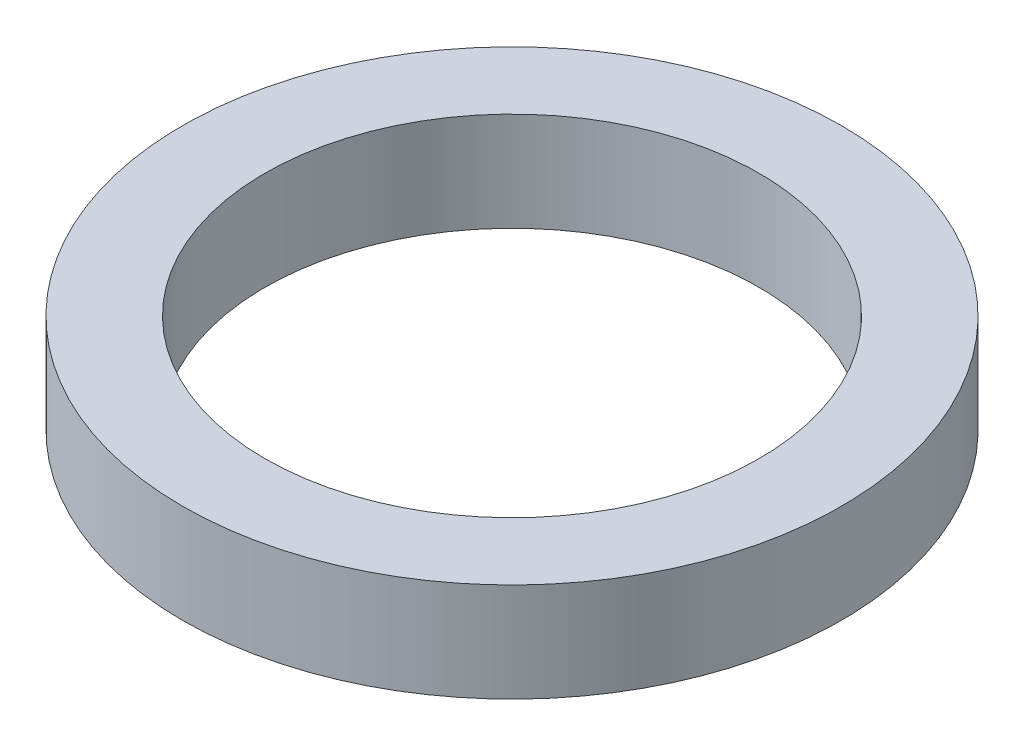
ISO-10303-21;
HEADER;
FILE_DESCRIPTION(('STEP AP214'),'2;1');
FILE_NAME('part.step','',(''),(''),'','','');
FILE_SCHEMA(('AUTOMOTIVE_DESIGN { 1 0 10303 214 1 1 1 1 }'));
ENDSEC;
DATA;
#1=APPLICATION_CONTEXT('core data for automotive mechanical design processes');
#2=APPLICATION_PROTOCOL_DEFINITION('international standard','automotive_design',2000,#1);
#3=PRODUCT_CONTEXT('',#1,'mechanical');
#4=PRODUCT('Part','Part','',(#3));
#5=PRODUCT_RELATED_PRODUCT_CATEGORY('part','',(#4));
#6=PRODUCT_DEFINITION_FORMATION('','',#4);
#7=PRODUCT_DEFINITION_CONTEXT('part definition',#1,'design');
#8=PRODUCT_DEFINITION('design','',#6,#7);
#9=PRODUCT_DEFINITION_SHAPE('','',#8);
#10=(LENGTH_UNIT() NAMED_UNIT(*) SI_UNIT(.MILLI.,.METRE.));
#11=(NAMED_UNIT(*) PLANE_ANGLE_UNIT() SI_UNIT($,.RADIAN.));
#12=(NAMED_UNIT(*) SI_UNIT($,.STERADIAN.) SOLID_ANGLE_UNIT());
#13=UNCERTAINTY_MEASURE_WITH_UNIT(LENGTH_MEASURE(1.E-05),#10,'distance_accuracy_value','');
#14=(GEOMETRIC_REPRESENTATION_CONTEXT(3) GLOBAL_UNCERTAINTY_ASSIGNED_CONTEXT((#13)) GLOBAL_UNIT_ASSIGNED_CONTEXT((#10,
#11,#12)) REPRESENTATION_CONTEXT('',''));
#15=CARTESIAN_POINT('',(0.,0.,0.));
#16=DIRECTION('',(0.,0.,1.));
#17=DIRECTION('',(1.,0.,0.));
#18=AXIS2_PLACEMENT_3D('',#15,#16,#17);
#19=CARTESIAN_POINT('',(0.,18.,0.));
#20=DIRECTION('',(0.,-1.,0.));
#21=DIRECTION('',(0.,0.,-1.));
#22=AXIS2_PLACEMENT_3D('',#19,#20,#21);
#23=CYLINDRICAL_SURFACE('',#22,60.);
#24=CARTESIAN_POINT('',(0.,18.,0.));
#25=DIRECTION('',(0.,1.,0.));
#26=DIRECTION('',(0.,0.,1.));
#27=AXIS2_PLACEMENT_3D('',#24,#25,#26);
#28=CIRCLE('',#27,60.);
#29=CARTESIAN_POINT('',(0.,18.,60.));
#30=VERTEX_POINT('',#29);
#31=EDGE_CURVE('E10',#30,#30,#28,.T.);
#32=ORIENTED_EDGE('',*,*,#31,.F.);
#33=EDGE_LOOP('',(#32));
#34=FACE_BOUND('',#33,.T.);
#35=CARTESIAN_POINT('',(0.,0.,0.));
#36=DIRECTION('',(0.,1.,0.));
#37=DIRECTION('',(0.,0.,1.));
#38=AXIS2_PLACEMENT_3D('',#35,#36,#37);
#39=CIRCLE('',#38,60.);
#40=CARTESIAN_POINT('',(0.,0.,60.));
#41=VERTEX_POINT('',#40);
#42=EDGE_CURVE('E37',#41,#41,#39,.T.);
#43=ORIENTED_EDGE('',*,*,#42,.T.);
#44=EDGE_LOOP('',(#43));
#45=FACE_BOUND('',#44,.T.);
#46=ADVANCED_FACE('F40',(#34,#45),#23,.T.);
#47=CARTESIAN_POINT('',(0.,18.,0.));
#48=DIRECTION('',(0.,1.,0.));
#49=DIRECTION('',(0.,0.,1.));
#50=AXIS2_PLACEMENT_3D('',#47,#48,#49);
#51=PLANE('',#50);
#52=CARTESIAN_POINT('',(0.,18.,0.));
#53=DIRECTION('',(0.,1.,0.));
#54=DIRECTION('',(0.,0.,1.));
#55=AXIS2_PLACEMENT_3D('',#52,#53,#54);
#56=CIRCLE('',#55,45.);
#57=CARTESIAN_POINT('',(0.,18.,45.));
#58=VERTEX_POINT('',#57);
#59=EDGE_CURVE('E50',#58,#58,#56,.T.);
#60=ORIENTED_EDGE('',*,*,#59,.F.);
#61=EDGE_LOOP('',(#60));
#62=FACE_BOUND('',#61,.T.);
#63=ORIENTED_EDGE('',*,*,#31,.T.);
#64=EDGE_LOOP('',(#63));
#65=FACE_BOUND('',#64,.T.);
#66=ADVANCED_FACE('F59',(#62,#65),#51,.T.);
#67=CARTESIAN_POINT('',(0.,0.,0.));
#68=DIRECTION('',(0.,1.,0.));
#69=DIRECTION('',(0.,0.,1.));
#70=AXIS2_PLACEMENT_3D('',#67,#68,#69);
#71=PLANE('',#70);
#72=CARTESIAN_POINT('',(0.,0.,0.));
#73=DIRECTION('',(0.,1.,0.));
#74=DIRECTION('',(0.,0.,1.));
#75=AXIS2_PLACEMENT_3D('',#72,#73,#74);
#76=CIRCLE('',#75,45.);
#77=CARTESIAN_POINT('',(0.,0.,45.));
#78=VERTEX_POINT('',#77);
#79=EDGE_CURVE('E47',#78,#78,#76,.T.);
#80=ORIENTED_EDGE('',*,*,#79,.T.);
#81=EDGE_LOOP('',(#80));
#82=FACE_BOUND('',#81,.T.);
#83=ORIENTED_EDGE('',*,*,#42,.F.);
#84=EDGE_LOOP('',(#83));
#85=FACE_BOUND('',#84,.T.);
#86=ADVANCED_FACE('F58',(#82,#85),#71,.F.);
#87=CARTESIAN_POINT('',(0.,18.,0.));
#88=DIRECTION('',(0.,-1.,0.));
#89=DIRECTION('',(0.,0.,-1.));
#90=AXIS2_PLACEMENT_3D('',#87,#88,#89);
#91=CYLINDRICAL_SURFACE('',#90,45.);
#92=ORIENTED_EDGE('',*,*,#59,.T.);
#93=EDGE_LOOP('',(#92));
#94=FACE_BOUND('',#93,.T.);
#95=ORIENTED_EDGE('',*,*,#79,.F.);
#96=EDGE_LOOP('',(#95));
#97=FACE_BOUND('',#96,.T.);
#98=ADVANCED_FACE('F54',(#94,#97),#91,.F.);
#99=CLOSED_SHELL('',(#46,#66,#86,#98));
#100=MANIFOLD_SOLID_BREP('B2',#99);
#101=ADVANCED_BREP_SHAPE_REPRESENTATION('',(#18,#100),#14);
#102=SHAPE_DEFINITION_REPRESENTATION(#9,#101);
ENDSEC;
END-ISO-10303-21;
